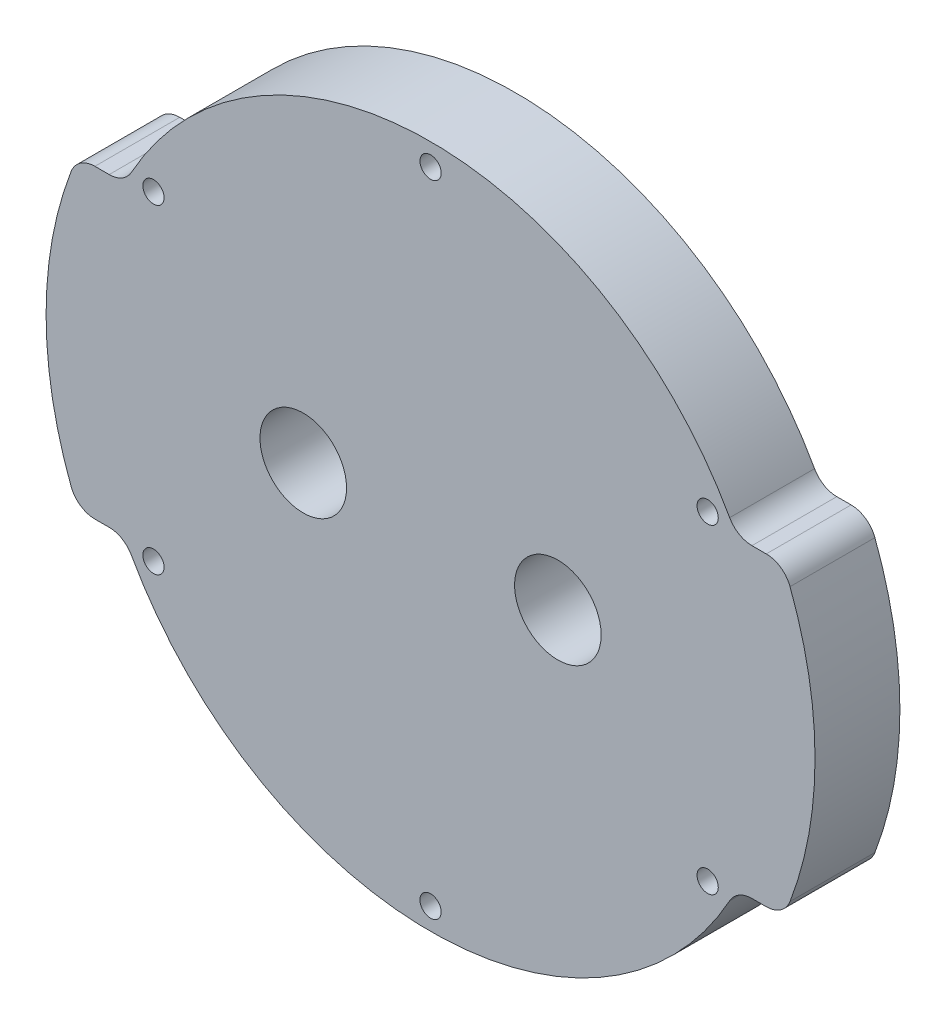
ISO-10303-21;
HEADER;
FILE_DESCRIPTION(('STEP AP214'),'2;1');
FILE_NAME('part.step','',(''),(''),'','','');
FILE_SCHEMA(('AUTOMOTIVE_DESIGN { 1 0 10303 214 1 1 1 1 }'));
ENDSEC;
DATA;
#1=APPLICATION_CONTEXT('core data for automotive mechanical design processes');
#2=APPLICATION_PROTOCOL_DEFINITION('international standard','automotive_design',2000,#1);
#3=PRODUCT_CONTEXT('',#1,'mechanical');
#4=PRODUCT('Part','Part','',(#3));
#5=PRODUCT_RELATED_PRODUCT_CATEGORY('part','',(#4));
#6=PRODUCT_DEFINITION_FORMATION('','',#4);
#7=PRODUCT_DEFINITION_CONTEXT('part definition',#1,'design');
#8=PRODUCT_DEFINITION('design','',#6,#7);
#9=PRODUCT_DEFINITION_SHAPE('','',#8);
#10=(LENGTH_UNIT() NAMED_UNIT(*) SI_UNIT(.MILLI.,.METRE.));
#11=(NAMED_UNIT(*) PLANE_ANGLE_UNIT() SI_UNIT($,.RADIAN.));
#12=(NAMED_UNIT(*) SI_UNIT($,.STERADIAN.) SOLID_ANGLE_UNIT());
#13=UNCERTAINTY_MEASURE_WITH_UNIT(LENGTH_MEASURE(1.E-05),#10,'distance_accuracy_value','');
#14=(GEOMETRIC_REPRESENTATION_CONTEXT(3) GLOBAL_UNCERTAINTY_ASSIGNED_CONTEXT((#13)) GLOBAL_UNIT_ASSIGNED_CONTEXT((#10,
#11,#12)) REPRESENTATION_CONTEXT('',''));
#15=CARTESIAN_POINT('',(0.,0.,0.));
#16=DIRECTION('',(0.,0.,1.));
#17=DIRECTION('',(1.,0.,0.));
#18=AXIS2_PLACEMENT_3D('',#15,#16,#17);
#19=CARTESIAN_POINT('',(0.,0.,10.));
#20=DIRECTION('',(0.,0.,-1.));
#21=DIRECTION('',(-1.,0.,0.));
#22=AXIS2_PLACEMENT_3D('',#19,#20,#21);
#23=CYLINDRICAL_SURFACE('',#22,45.3);
#24=CARTESIAN_POINT('',(0.,0.,0.));
#25=DIRECTION('',(0.,0.,1.));
#26=DIRECTION('',(1.,0.,0.));
#27=AXIS2_PLACEMENT_3D('',#24,#25,#26);
#28=CIRCLE('',#27,45.3);
#29=CARTESIAN_POINT('',(42.3561491706549,-16.063829787234,0.));
#30=VERTEX_POINT('',#29);
#31=CARTESIAN_POINT('',(42.3561491706549,16.063829787234,0.));
#32=VERTEX_POINT('',#31);
#33=EDGE_CURVE('E191',#30,#32,#28,.T.);
#34=ORIENTED_EDGE('',*,*,#33,.T.);
#35=DIRECTION('',(0.,0.,-1.));
#36=VECTOR('',#35,1.);
#37=CARTESIAN_POINT('',(42.3561491706549,16.063829787234,10.));
#38=LINE('',#37,#36);
#39=CARTESIAN_POINT('',(42.3561491706549,16.063829787234,10.));
#40=VERTEX_POINT('',#39);
#41=EDGE_CURVE('E201',#32,#40,#38,.F.);
#42=ORIENTED_EDGE('',*,*,#41,.T.);
#43=CARTESIAN_POINT('',(0.,0.,10.));
#44=DIRECTION('',(0.,0.,1.));
#45=DIRECTION('',(1.,0.,0.));
#46=AXIS2_PLACEMENT_3D('',#43,#44,#45);
#47=CIRCLE('',#46,45.3);
#48=CARTESIAN_POINT('',(42.3561491706549,-16.063829787234,10.));
#49=VERTEX_POINT('',#48);
#50=EDGE_CURVE('E187',#49,#40,#47,.T.);
#51=ORIENTED_EDGE('',*,*,#50,.F.);
#52=DIRECTION('',(0.,0.,-1.));
#53=VECTOR('',#52,1.);
#54=CARTESIAN_POINT('',(42.3561491706549,-16.063829787234,10.));
#55=LINE('',#54,#53);
#56=EDGE_CURVE('E198',#49,#30,#55,.T.);
#57=ORIENTED_EDGE('',*,*,#56,.T.);
#58=EDGE_LOOP('',(#34,#42,#51,#57));
#59=FACE_BOUND('',#58,.T.);
#60=ADVANCED_FACE('F33',(#59),#23,.T.);
#61=CARTESIAN_POINT('',(-42.3561491706549,16.063829787234,0.));
#62=VERTEX_POINT('',#61);
#63=CARTESIAN_POINT('',(-42.3561491706549,-16.063829787234,0.));
#64=VERTEX_POINT('',#63);
#65=EDGE_CURVE('E188',#62,#64,#28,.T.);
#66=ORIENTED_EDGE('',*,*,#65,.T.);
#67=DIRECTION('',(0.,0.,-1.));
#68=VECTOR('',#67,1.);
#69=CARTESIAN_POINT('',(-42.3561491706549,-16.063829787234,10.));
#70=LINE('',#69,#68);
#71=CARTESIAN_POINT('',(-42.3561491706549,-16.063829787234,10.));
#72=VERTEX_POINT('',#71);
#73=EDGE_CURVE('E234',#64,#72,#70,.F.);
#74=ORIENTED_EDGE('',*,*,#73,.T.);
#75=CARTESIAN_POINT('',(-42.3561491706549,16.063829787234,10.));
#76=VERTEX_POINT('',#75);
#77=EDGE_CURVE('E183',#76,#72,#47,.T.);
#78=ORIENTED_EDGE('',*,*,#77,.F.);
#79=DIRECTION('',(0.,0.,-1.));
#80=VECTOR('',#79,1.);
#81=CARTESIAN_POINT('',(-42.3561491706549,16.063829787234,10.));
#82=LINE('',#81,#80);
#83=EDGE_CURVE('E232',#76,#62,#82,.T.);
#84=ORIENTED_EDGE('',*,*,#83,.T.);
#85=EDGE_LOOP('',(#66,#74,#78,#84));
#86=FACE_BOUND('',#85,.T.);
#87=ADVANCED_FACE('F287',(#86),#23,.T.);
#88=CARTESIAN_POINT('',(0.,0.,10.));
#89=DIRECTION('',(0.,0.,1.));
#90=DIRECTION('',(1.,0.,0.));
#91=AXIS2_PLACEMENT_3D('',#88,#89,#90);
#92=PLANE('',#91);
#93=CARTESIAN_POINT('',(-15.,1.04744440165294E-13,10.));
#94=DIRECTION('',(0.,0.,1.));
#95=DIRECTION('',(1.,0.,0.));
#96=AXIS2_PLACEMENT_3D('',#93,#94,#95);
#97=CIRCLE('',#96,5.1);
#98=CARTESIAN_POINT('',(-9.9,1.04744440165294E-13,10.));
#99=VERTEX_POINT('',#98);
#100=EDGE_CURVE('E356',#99,#99,#97,.T.);
#101=ORIENTED_EDGE('',*,*,#100,.F.);
#102=EDGE_LOOP('',(#101));
#103=FACE_BOUND('',#102,.T.);
#104=CARTESIAN_POINT('',(15.,0.,10.));
#105=DIRECTION('',(0.,0.,1.));
#106=DIRECTION('',(1.,0.,0.));
#107=AXIS2_PLACEMENT_3D('',#104,#105,#106);
#108=CIRCLE('',#107,5.1);
#109=CARTESIAN_POINT('',(20.1,0.,10.));
#110=VERTEX_POINT('',#109);
#111=EDGE_CURVE('E358',#110,#110,#108,.T.);
#112=ORIENTED_EDGE('',*,*,#111,.F.);
#113=EDGE_LOOP('',(#112));
#114=FACE_BOUND('',#113,.T.);
#115=CARTESIAN_POINT('',(-32.6491577226728,18.8499999999991,10.));
#116=DIRECTION('',(0.,0.,1.));
#117=DIRECTION('',(1.,0.,0.));
#118=AXIS2_PLACEMENT_3D('',#115,#116,#117);
#119=CIRCLE('',#118,1.25000000000123);
#120=CARTESIAN_POINT('',(-31.3991577226716,18.8499999999991,10.));
#121=VERTEX_POINT('',#120);
#122=EDGE_CURVE('E364',#121,#121,#119,.T.);
#123=ORIENTED_EDGE('',*,*,#122,.F.);
#124=EDGE_LOOP('',(#123));
#125=FACE_BOUND('',#124,.T.);
#126=CARTESIAN_POINT('',(-32.6491577226717,-18.8500000000009,10.));
#127=DIRECTION('',(0.,0.,1.));
#128=DIRECTION('',(1.,0.,0.));
#129=AXIS2_PLACEMENT_3D('',#126,#127,#128);
#130=CIRCLE('',#129,1.25000000000215);
#131=CARTESIAN_POINT('',(-31.3991577226696,-18.8500000000009,10.));
#132=VERTEX_POINT('',#131);
#133=EDGE_CURVE('E370',#132,#132,#130,.T.);
#134=ORIENTED_EDGE('',*,*,#133,.F.);
#135=EDGE_LOOP('',(#134));
#136=FACE_BOUND('',#135,.T.);
#137=CARTESIAN_POINT('',(2.13376305418689E-12,-37.7,10.));
#138=DIRECTION('',(0.,0.,1.));
#139=DIRECTION('',(1.,0.,0.));
#140=AXIS2_PLACEMENT_3D('',#137,#138,#139);
#141=CIRCLE('',#140,1.25000000000229);
#142=CARTESIAN_POINT('',(1.25000000000443,-37.7,10.));
#143=VERTEX_POINT('',#142);
#144=EDGE_CURVE('E376',#143,#143,#141,.T.);
#145=ORIENTED_EDGE('',*,*,#144,.F.);
#146=EDGE_LOOP('',(#145));
#147=FACE_BOUND('',#146,.T.);
#148=CARTESIAN_POINT('',(32.6491577226749,-18.8499999999991,10.));
#149=DIRECTION('',(0.,0.,1.));
#150=DIRECTION('',(1.,0.,0.));
#151=AXIS2_PLACEMENT_3D('',#148,#149,#150);
#152=CIRCLE('',#151,1.25000000000144);
#153=CARTESIAN_POINT('',(33.8991577226764,-18.8499999999991,10.));
#154=VERTEX_POINT('',#153);
#155=EDGE_CURVE('E382',#154,#154,#152,.T.);
#156=ORIENTED_EDGE('',*,*,#155,.F.);
#157=EDGE_LOOP('',(#156));
#158=FACE_BOUND('',#157,.T.);
#159=CARTESIAN_POINT('',(32.6491577226739,18.8500000000009,10.));
#160=DIRECTION('',(0.,0.,1.));
#161=DIRECTION('',(1.,0.,0.));
#162=AXIS2_PLACEMENT_3D('',#159,#160,#161);
#163=CIRCLE('',#162,1.25000000000034);
#164=CARTESIAN_POINT('',(33.8991577226742,18.8500000000009,10.));
#165=VERTEX_POINT('',#164);
#166=EDGE_CURVE('E388',#165,#165,#163,.T.);
#167=ORIENTED_EDGE('',*,*,#166,.F.);
#168=EDGE_LOOP('',(#167));
#169=FACE_BOUND('',#168,.T.);
#170=CARTESIAN_POINT('',(0.,37.7,10.));
#171=DIRECTION('',(0.,0.,1.));
#172=DIRECTION('',(1.,0.,0.));
#173=AXIS2_PLACEMENT_3D('',#170,#171,#172);
#174=CIRCLE('',#173,1.25);
#175=CARTESIAN_POINT('',(1.25,37.7,10.));
#176=VERTEX_POINT('',#175);
#177=EDGE_CURVE('E394',#176,#176,#174,.T.);
#178=ORIENTED_EDGE('',*,*,#177,.F.);
#179=EDGE_LOOP('',(#178));
#180=FACE_BOUND('',#179,.T.);
#181=ORIENTED_EDGE('',*,*,#50,.T.);
#182=CARTESIAN_POINT('',(39.5511061792208,15.,10.));
#183=DIRECTION('',(0.,0.,1.));
#184=DIRECTION('',(1.,0.,0.));
#185=AXIS2_PLACEMENT_3D('',#182,#183,#184);
#186=CIRCLE('',#185,3.);
#187=CARTESIAN_POINT('',(39.5511061792208,18.,10.));
#188=VERTEX_POINT('',#187);
#189=EDGE_CURVE('E173',#40,#188,#186,.T.);
#190=ORIENTED_EDGE('',*,*,#189,.T.);
#191=DIRECTION('',(1.,0.,0.));
#192=VECTOR('',#191,1.);
#193=CARTESIAN_POINT('',(36.0567608084808,18.,10.));
#194=LINE('',#193,#192);
#195=CARTESIAN_POINT('',(37.8667400234031,18.,10.));
#196=VERTEX_POINT('',#195);
#197=EDGE_CURVE('E164',#196,#188,#194,.T.);
#198=ORIENTED_EDGE('',*,*,#197,.F.);
#199=CARTESIAN_POINT('',(37.8667400234031,21.,10.));
#200=DIRECTION('',(0.,0.,1.));
#201=DIRECTION('',(1.,0.,0.));
#202=AXIS2_PLACEMENT_3D('',#199,#200,#201);
#203=CIRCLE('',#202,3.);
#204=CARTESIAN_POINT('',(35.2431783589641,19.5450346420323,10.));
#205=VERTEX_POINT('',#204);
#206=EDGE_CURVE('E147',#196,#205,#203,.F.);
#207=ORIENTED_EDGE('',*,*,#206,.T.);
#208=CARTESIAN_POINT('',(0.,0.,10.));
#209=DIRECTION('',(0.,0.,-1.));
#210=DIRECTION('',(1.,0.,0.));
#211=AXIS2_PLACEMENT_3D('',#208,#209,#210);
#212=CIRCLE('',#211,40.3);
#213=CARTESIAN_POINT('',(-35.2431783589641,19.5450346420323,10.));
#214=VERTEX_POINT('',#213);
#215=EDGE_CURVE('E175',#214,#205,#212,.T.);
#216=ORIENTED_EDGE('',*,*,#215,.F.);
#217=CARTESIAN_POINT('',(-37.8667400234031,21.,10.));
#218=DIRECTION('',(0.,0.,1.));
#219=DIRECTION('',(1.,0.,0.));
#220=AXIS2_PLACEMENT_3D('',#217,#218,#219);
#221=CIRCLE('',#220,3.);
#222=CARTESIAN_POINT('',(-37.8667400234031,18.,10.));
#223=VERTEX_POINT('',#222);
#224=EDGE_CURVE('E41',#214,#223,#221,.F.);
#225=ORIENTED_EDGE('',*,*,#224,.T.);
#226=DIRECTION('',(1.,0.,0.));
#227=VECTOR('',#226,1.);
#228=CARTESIAN_POINT('',(-36.0567608084808,18.,10.));
#229=LINE('',#228,#227);
#230=CARTESIAN_POINT('',(-39.5511061792208,18.,10.));
#231=VERTEX_POINT('',#230);
#232=EDGE_CURVE('E174',#231,#223,#229,.T.);
#233=ORIENTED_EDGE('',*,*,#232,.F.);
#234=CARTESIAN_POINT('',(-39.5511061792208,15.,10.));
#235=DIRECTION('',(0.,0.,1.));
#236=DIRECTION('',(1.,0.,0.));
#237=AXIS2_PLACEMENT_3D('',#234,#235,#236);
#238=CIRCLE('',#237,3.);
#239=EDGE_CURVE('E204',#231,#76,#238,.T.);
#240=ORIENTED_EDGE('',*,*,#239,.T.);
#241=ORIENTED_EDGE('',*,*,#77,.T.);
#242=CARTESIAN_POINT('',(-39.5511061792208,-15.,10.));
#243=DIRECTION('',(0.,0.,1.));
#244=DIRECTION('',(1.,0.,0.));
#245=AXIS2_PLACEMENT_3D('',#242,#243,#244);
#246=CIRCLE('',#245,3.);
#247=CARTESIAN_POINT('',(-39.5511061792208,-18.,10.));
#248=VERTEX_POINT('',#247);
#249=EDGE_CURVE('E206',#72,#248,#246,.T.);
#250=ORIENTED_EDGE('',*,*,#249,.T.);
#251=DIRECTION('',(-1.,0.,0.));
#252=VECTOR('',#251,1.);
#253=CARTESIAN_POINT('',(-36.0567608084808,-18.,10.));
#254=LINE('',#253,#252);
#255=CARTESIAN_POINT('',(-37.8667400234031,-18.,10.));
#256=VERTEX_POINT('',#255);
#257=EDGE_CURVE('E409',#256,#248,#254,.T.);
#258=ORIENTED_EDGE('',*,*,#257,.F.);
#259=CARTESIAN_POINT('',(-37.8667400234031,-21.,10.));
#260=DIRECTION('',(0.,0.,1.));
#261=DIRECTION('',(1.,0.,0.));
#262=AXIS2_PLACEMENT_3D('',#259,#260,#261);
#263=CIRCLE('',#262,3.);
#264=CARTESIAN_POINT('',(-35.2431783589641,-19.5450346420323,10.));
#265=VERTEX_POINT('',#264);
#266=EDGE_CURVE('E245',#256,#265,#263,.F.);
#267=ORIENTED_EDGE('',*,*,#266,.T.);
#268=CARTESIAN_POINT('',(0.,0.,10.));
#269=DIRECTION('',(0.,0.,-1.));
#270=DIRECTION('',(1.,0.,0.));
#271=AXIS2_PLACEMENT_3D('',#268,#269,#270);
#272=CIRCLE('',#271,40.3);
#273=CARTESIAN_POINT('',(35.2431783589641,-19.5450346420323,10.));
#274=VERTEX_POINT('',#273);
#275=EDGE_CURVE('E400',#274,#265,#272,.T.);
#276=ORIENTED_EDGE('',*,*,#275,.F.);
#277=CARTESIAN_POINT('',(37.8667400234031,-21.,10.));
#278=DIRECTION('',(0.,0.,1.));
#279=DIRECTION('',(1.,0.,0.));
#280=AXIS2_PLACEMENT_3D('',#277,#278,#279);
#281=CIRCLE('',#280,3.);
#282=CARTESIAN_POINT('',(37.8667400234031,-18.,10.));
#283=VERTEX_POINT('',#282);
#284=EDGE_CURVE('E241',#274,#283,#281,.F.);
#285=ORIENTED_EDGE('',*,*,#284,.T.);
#286=DIRECTION('',(-1.,0.,0.));
#287=VECTOR('',#286,1.);
#288=CARTESIAN_POINT('',(36.0567608084808,-18.,10.));
#289=LINE('',#288,#287);
#290=CARTESIAN_POINT('',(39.5511061792208,-18.,10.));
#291=VERTEX_POINT('',#290);
#292=EDGE_CURVE('E263',#291,#283,#289,.T.);
#293=ORIENTED_EDGE('',*,*,#292,.F.);
#294=CARTESIAN_POINT('',(39.5511061792208,-15.,10.));
#295=DIRECTION('',(0.,0.,1.));
#296=DIRECTION('',(1.,0.,0.));
#297=AXIS2_PLACEMENT_3D('',#294,#295,#296);
#298=CIRCLE('',#297,3.);
#299=EDGE_CURVE('E208',#291,#49,#298,.T.);
#300=ORIENTED_EDGE('',*,*,#299,.T.);
#301=EDGE_LOOP('',(#181,#190,#198,#207,#216,#225,#233,#240,#241,#250,#258,#267,#276,#285,#293,#300));
#302=FACE_BOUND('',#301,.T.);
#303=ADVANCED_FACE('F172',(#103,#114,#125,#136,#147,#158,#169,#180,#302),#92,.T.);
#304=CARTESIAN_POINT('',(0.,0.,0.));
#305=DIRECTION('',(0.,0.,1.));
#306=DIRECTION('',(1.,0.,0.));
#307=AXIS2_PLACEMENT_3D('',#304,#305,#306);
#308=PLANE('',#307);
#309=CARTESIAN_POINT('',(-15.,1.04744440165294E-13,0.));
#310=DIRECTION('',(0.,0.,1.));
#311=DIRECTION('',(1.,0.,0.));
#312=AXIS2_PLACEMENT_3D('',#309,#310,#311);
#313=CIRCLE('',#312,5.1);
#314=CARTESIAN_POINT('',(-9.9,1.04744440165294E-13,0.));
#315=VERTEX_POINT('',#314);
#316=EDGE_CURVE('E353',#315,#315,#313,.T.);
#317=ORIENTED_EDGE('',*,*,#316,.T.);
#318=EDGE_LOOP('',(#317));
#319=FACE_BOUND('',#318,.T.);
#320=CARTESIAN_POINT('',(15.,0.,0.));
#321=DIRECTION('',(0.,0.,1.));
#322=DIRECTION('',(1.,0.,0.));
#323=AXIS2_PLACEMENT_3D('',#320,#321,#322);
#324=CIRCLE('',#323,5.1);
#325=CARTESIAN_POINT('',(20.1,0.,0.));
#326=VERTEX_POINT('',#325);
#327=EDGE_CURVE('E361',#326,#326,#324,.T.);
#328=ORIENTED_EDGE('',*,*,#327,.T.);
#329=EDGE_LOOP('',(#328));
#330=FACE_BOUND('',#329,.T.);
#331=CARTESIAN_POINT('',(-32.6491577226728,18.8499999999991,0.));
#332=DIRECTION('',(0.,0.,1.));
#333=DIRECTION('',(1.,0.,0.));
#334=AXIS2_PLACEMENT_3D('',#331,#332,#333);
#335=CIRCLE('',#334,1.25000000000123);
#336=CARTESIAN_POINT('',(-31.3991577226716,18.8499999999991,0.));
#337=VERTEX_POINT('',#336);
#338=EDGE_CURVE('E367',#337,#337,#335,.T.);
#339=ORIENTED_EDGE('',*,*,#338,.T.);
#340=EDGE_LOOP('',(#339));
#341=FACE_BOUND('',#340,.T.);
#342=CARTESIAN_POINT('',(-32.6491577226717,-18.8500000000009,0.));
#343=DIRECTION('',(0.,0.,1.));
#344=DIRECTION('',(1.,0.,0.));
#345=AXIS2_PLACEMENT_3D('',#342,#343,#344);
#346=CIRCLE('',#345,1.25000000000215);
#347=CARTESIAN_POINT('',(-31.3991577226696,-18.8500000000009,0.));
#348=VERTEX_POINT('',#347);
#349=EDGE_CURVE('E373',#348,#348,#346,.T.);
#350=ORIENTED_EDGE('',*,*,#349,.T.);
#351=EDGE_LOOP('',(#350));
#352=FACE_BOUND('',#351,.T.);
#353=CARTESIAN_POINT('',(2.13376305418689E-12,-37.7,0.));
#354=DIRECTION('',(0.,0.,1.));
#355=DIRECTION('',(1.,0.,0.));
#356=AXIS2_PLACEMENT_3D('',#353,#354,#355);
#357=CIRCLE('',#356,1.25000000000229);
#358=CARTESIAN_POINT('',(1.25000000000443,-37.7,0.));
#359=VERTEX_POINT('',#358);
#360=EDGE_CURVE('E379',#359,#359,#357,.T.);
#361=ORIENTED_EDGE('',*,*,#360,.T.);
#362=EDGE_LOOP('',(#361));
#363=FACE_BOUND('',#362,.T.);
#364=CARTESIAN_POINT('',(32.6491577226749,-18.8499999999991,0.));
#365=DIRECTION('',(0.,0.,1.));
#366=DIRECTION('',(1.,0.,0.));
#367=AXIS2_PLACEMENT_3D('',#364,#365,#366);
#368=CIRCLE('',#367,1.25000000000144);
#369=CARTESIAN_POINT('',(33.8991577226764,-18.8499999999991,0.));
#370=VERTEX_POINT('',#369);
#371=EDGE_CURVE('E385',#370,#370,#368,.T.);
#372=ORIENTED_EDGE('',*,*,#371,.T.);
#373=EDGE_LOOP('',(#372));
#374=FACE_BOUND('',#373,.T.);
#375=CARTESIAN_POINT('',(32.6491577226739,18.8500000000009,0.));
#376=DIRECTION('',(0.,0.,1.));
#377=DIRECTION('',(1.,0.,0.));
#378=AXIS2_PLACEMENT_3D('',#375,#376,#377);
#379=CIRCLE('',#378,1.25000000000034);
#380=CARTESIAN_POINT('',(33.8991577226742,18.8500000000009,0.));
#381=VERTEX_POINT('',#380);
#382=EDGE_CURVE('E391',#381,#381,#379,.T.);
#383=ORIENTED_EDGE('',*,*,#382,.T.);
#384=EDGE_LOOP('',(#383));
#385=FACE_BOUND('',#384,.T.);
#386=CARTESIAN_POINT('',(0.,37.7,0.));
#387=DIRECTION('',(0.,0.,1.));
#388=DIRECTION('',(1.,0.,0.));
#389=AXIS2_PLACEMENT_3D('',#386,#387,#388);
#390=CIRCLE('',#389,1.25);
#391=CARTESIAN_POINT('',(1.25,37.7,0.));
#392=VERTEX_POINT('',#391);
#393=EDGE_CURVE('E397',#392,#392,#390,.T.);
#394=ORIENTED_EDGE('',*,*,#393,.T.);
#395=EDGE_LOOP('',(#394));
#396=FACE_BOUND('',#395,.T.);
#397=DIRECTION('',(1.,0.,0.));
#398=VECTOR('',#397,1.);
#399=CARTESIAN_POINT('',(36.0567608084808,18.,0.));
#400=LINE('',#399,#398);
#401=CARTESIAN_POINT('',(37.8667400234031,18.,0.));
#402=VERTEX_POINT('',#401);
#403=CARTESIAN_POINT('',(39.5511061792208,18.,0.));
#404=VERTEX_POINT('',#403);
#405=EDGE_CURVE('E167',#402,#404,#400,.T.);
#406=ORIENTED_EDGE('',*,*,#405,.T.);
#407=CARTESIAN_POINT('',(39.5511061792208,15.,0.));
#408=DIRECTION('',(0.,0.,1.));
#409=DIRECTION('',(1.,0.,0.));
#410=AXIS2_PLACEMENT_3D('',#407,#408,#409);
#411=CIRCLE('',#410,3.);
#412=EDGE_CURVE('E216',#404,#32,#411,.F.);
#413=ORIENTED_EDGE('',*,*,#412,.T.);
#414=ORIENTED_EDGE('',*,*,#33,.F.);
#415=CARTESIAN_POINT('',(39.5511061792208,-15.,0.));
#416=DIRECTION('',(0.,0.,1.));
#417=DIRECTION('',(1.,0.,0.));
#418=AXIS2_PLACEMENT_3D('',#415,#416,#417);
#419=CIRCLE('',#418,3.);
#420=CARTESIAN_POINT('',(39.5511061792208,-18.,0.));
#421=VERTEX_POINT('',#420);
#422=EDGE_CURVE('E214',#30,#421,#419,.F.);
#423=ORIENTED_EDGE('',*,*,#422,.T.);
#424=DIRECTION('',(-1.,0.,0.));
#425=VECTOR('',#424,1.);
#426=CARTESIAN_POINT('',(0.,-18.,0.));
#427=LINE('',#426,#425);
#428=CARTESIAN_POINT('',(37.8667400234031,-18.,0.));
#429=VERTEX_POINT('',#428);
#430=EDGE_CURVE('E186',#421,#429,#427,.T.);
#431=ORIENTED_EDGE('',*,*,#430,.T.);
#432=CARTESIAN_POINT('',(37.8667400234031,-21.,0.));
#433=DIRECTION('',(0.,0.,1.));
#434=DIRECTION('',(1.,0.,0.));
#435=AXIS2_PLACEMENT_3D('',#432,#433,#434);
#436=CIRCLE('',#435,3.);
#437=CARTESIAN_POINT('',(35.2431783589641,-19.5450346420323,0.));
#438=VERTEX_POINT('',#437);
#439=EDGE_CURVE('E243',#429,#438,#436,.T.);
#440=ORIENTED_EDGE('',*,*,#439,.T.);
#441=CARTESIAN_POINT('',(0.,0.,0.));
#442=DIRECTION('',(0.,0.,-1.));
#443=DIRECTION('',(1.,0.,0.));
#444=AXIS2_PLACEMENT_3D('',#441,#442,#443);
#445=CIRCLE('',#444,40.3);
#446=CARTESIAN_POINT('',(-35.2431783589641,-19.5450346420323,0.));
#447=VERTEX_POINT('',#446);
#448=EDGE_CURVE('E403',#438,#447,#445,.T.);
#449=ORIENTED_EDGE('',*,*,#448,.T.);
#450=CARTESIAN_POINT('',(-37.8667400234031,-21.,0.));
#451=DIRECTION('',(0.,0.,1.));
#452=DIRECTION('',(1.,0.,0.));
#453=AXIS2_PLACEMENT_3D('',#450,#451,#452);
#454=CIRCLE('',#453,3.);
#455=CARTESIAN_POINT('',(-37.8667400234031,-18.,0.));
#456=VERTEX_POINT('',#455);
#457=EDGE_CURVE('E247',#447,#456,#454,.T.);
#458=ORIENTED_EDGE('',*,*,#457,.T.);
#459=DIRECTION('',(-1.,0.,0.));
#460=VECTOR('',#459,1.);
#461=CARTESIAN_POINT('',(-36.0567608084808,-18.,0.));
#462=LINE('',#461,#460);
#463=CARTESIAN_POINT('',(-39.5511061792208,-18.,0.));
#464=VERTEX_POINT('',#463);
#465=EDGE_CURVE('E179',#456,#464,#462,.T.);
#466=ORIENTED_EDGE('',*,*,#465,.T.);
#467=CARTESIAN_POINT('',(-39.5511061792208,-15.,0.));
#468=DIRECTION('',(0.,0.,1.));
#469=DIRECTION('',(1.,0.,0.));
#470=AXIS2_PLACEMENT_3D('',#467,#468,#469);
#471=CIRCLE('',#470,3.);
#472=EDGE_CURVE('E212',#464,#64,#471,.F.);
#473=ORIENTED_EDGE('',*,*,#472,.T.);
#474=ORIENTED_EDGE('',*,*,#65,.F.);
#475=CARTESIAN_POINT('',(-39.5511061792208,15.,0.));
#476=DIRECTION('',(0.,0.,1.));
#477=DIRECTION('',(1.,0.,0.));
#478=AXIS2_PLACEMENT_3D('',#475,#476,#477);
#479=CIRCLE('',#478,3.);
#480=CARTESIAN_POINT('',(-39.5511061792208,18.,0.));
#481=VERTEX_POINT('',#480);
#482=EDGE_CURVE('E55',#62,#481,#479,.F.);
#483=ORIENTED_EDGE('',*,*,#482,.T.);
#484=DIRECTION('',(1.,0.,0.));
#485=VECTOR('',#484,1.);
#486=CARTESIAN_POINT('',(-36.0567608084808,18.,0.));
#487=LINE('',#486,#485);
#488=CARTESIAN_POINT('',(-37.8667400234031,18.,0.));
#489=VERTEX_POINT('',#488);
#490=EDGE_CURVE('E257',#481,#489,#487,.T.);
#491=ORIENTED_EDGE('',*,*,#490,.T.);
#492=CARTESIAN_POINT('',(-37.8667400234031,21.,0.));
#493=DIRECTION('',(0.,0.,1.));
#494=DIRECTION('',(1.,0.,0.));
#495=AXIS2_PLACEMENT_3D('',#492,#493,#494);
#496=CIRCLE('',#495,3.);
#497=CARTESIAN_POINT('',(-35.2431783589641,19.5450346420323,0.));
#498=VERTEX_POINT('',#497);
#499=EDGE_CURVE('E11',#489,#498,#496,.T.);
#500=ORIENTED_EDGE('',*,*,#499,.T.);
#501=CARTESIAN_POINT('',(0.,0.,0.));
#502=DIRECTION('',(0.,0.,-1.));
#503=DIRECTION('',(1.,0.,0.));
#504=AXIS2_PLACEMENT_3D('',#501,#502,#503);
#505=CIRCLE('',#504,40.3);
#506=CARTESIAN_POINT('',(35.2431783589641,19.5450346420323,0.));
#507=VERTEX_POINT('',#506);
#508=EDGE_CURVE('E177',#498,#507,#505,.T.);
#509=ORIENTED_EDGE('',*,*,#508,.T.);
#510=CARTESIAN_POINT('',(37.8667400234031,21.,0.));
#511=DIRECTION('',(0.,0.,1.));
#512=DIRECTION('',(1.,0.,0.));
#513=AXIS2_PLACEMENT_3D('',#510,#511,#512);
#514=CIRCLE('',#513,3.);
#515=EDGE_CURVE('E157',#507,#402,#514,.T.);
#516=ORIENTED_EDGE('',*,*,#515,.T.);
#517=EDGE_LOOP('',(#406,#413,#414,#423,#431,#440,#449,#458,#466,#473,#474,#483,#491,#500,#509,#516));
#518=FACE_BOUND('',#517,.T.);
#519=ADVANCED_FACE('F256',(#319,#330,#341,#352,#363,#374,#385,#396,#518),#308,.F.);
#520=CARTESIAN_POINT('',(0.,0.,0.));
#521=DIRECTION('',(0.,0.,1.));
#522=DIRECTION('',(1.,0.,0.));
#523=AXIS2_PLACEMENT_3D('',#520,#521,#522);
#524=CYLINDRICAL_SURFACE('',#523,40.3);
#525=ORIENTED_EDGE('',*,*,#215,.T.);
#526=DIRECTION('',(0.,0.,1.));
#527=VECTOR('',#526,1.);
#528=CARTESIAN_POINT('',(35.2431783589641,19.5450346420323,0.));
#529=LINE('',#528,#527);
#530=EDGE_CURVE('E152',#205,#507,#529,.F.);
#531=ORIENTED_EDGE('',*,*,#530,.T.);
#532=ORIENTED_EDGE('',*,*,#508,.F.);
#533=DIRECTION('',(0.,0.,1.));
#534=VECTOR('',#533,1.);
#535=CARTESIAN_POINT('',(-35.2431783589641,19.5450346420323,0.));
#536=LINE('',#535,#534);
#537=EDGE_CURVE('E168',#498,#214,#536,.T.);
#538=ORIENTED_EDGE('',*,*,#537,.T.);
#539=EDGE_LOOP('',(#525,#531,#532,#538));
#540=FACE_BOUND('',#539,.T.);
#541=ADVANCED_FACE('F259',(#540),#524,.T.);
#542=CARTESIAN_POINT('',(-36.0567608084808,18.,0.));
#543=DIRECTION('',(0.,-1.,0.));
#544=DIRECTION('',(1.,0.,0.));
#545=AXIS2_PLACEMENT_3D('',#542,#543,#544);
#546=PLANE('',#545);
#547=ORIENTED_EDGE('',*,*,#490,.F.);
#548=DIRECTION('',(0.,0.,-1.));
#549=VECTOR('',#548,1.);
#550=CARTESIAN_POINT('',(-39.5511061792208,18.,0.));
#551=LINE('',#550,#549);
#552=EDGE_CURVE('E158',#481,#231,#551,.F.);
#553=ORIENTED_EDGE('',*,*,#552,.T.);
#554=ORIENTED_EDGE('',*,*,#232,.T.);
#555=DIRECTION('',(0.,0.,-1.));
#556=VECTOR('',#555,1.);
#557=CARTESIAN_POINT('',(-37.8667400234031,18.,0.));
#558=LINE('',#557,#556);
#559=EDGE_CURVE('E48',#223,#489,#558,.T.);
#560=ORIENTED_EDGE('',*,*,#559,.T.);
#561=EDGE_LOOP('',(#547,#553,#554,#560));
#562=FACE_BOUND('',#561,.T.);
#563=ADVANCED_FACE('F251',(#562),#546,.F.);
#564=CARTESIAN_POINT('',(36.0567608084808,18.,0.));
#565=DIRECTION('',(0.,-1.,0.));
#566=DIRECTION('',(1.,0.,0.));
#567=AXIS2_PLACEMENT_3D('',#564,#565,#566);
#568=PLANE('',#567);
#569=ORIENTED_EDGE('',*,*,#405,.F.);
#570=DIRECTION('',(0.,0.,-1.));
#571=VECTOR('',#570,1.);
#572=CARTESIAN_POINT('',(37.8667400234031,18.,10.));
#573=LINE('',#572,#571);
#574=EDGE_CURVE('E151',#402,#196,#573,.F.);
#575=ORIENTED_EDGE('',*,*,#574,.T.);
#576=ORIENTED_EDGE('',*,*,#197,.T.);
#577=DIRECTION('',(0.,0.,-1.));
#578=VECTOR('',#577,1.);
#579=CARTESIAN_POINT('',(39.5511061792208,18.,0.));
#580=LINE('',#579,#578);
#581=EDGE_CURVE('E169',#188,#404,#580,.T.);
#582=ORIENTED_EDGE('',*,*,#581,.T.);
#583=EDGE_LOOP('',(#569,#575,#576,#582));
#584=FACE_BOUND('',#583,.T.);
#585=ADVANCED_FACE('F163',(#584),#568,.F.);
#586=CARTESIAN_POINT('',(36.0567608084808,-18.,0.));
#587=DIRECTION('',(0.,1.,0.));
#588=DIRECTION('',(0.,0.,1.));
#589=AXIS2_PLACEMENT_3D('',#586,#587,#588);
#590=PLANE('',#589);
#591=ORIENTED_EDGE('',*,*,#430,.F.);
#592=DIRECTION('',(0.,0.,-1.));
#593=VECTOR('',#592,1.);
#594=CARTESIAN_POINT('',(39.5511061792208,-18.,0.));
#595=LINE('',#594,#593);
#596=EDGE_CURVE('E220',#421,#291,#595,.F.);
#597=ORIENTED_EDGE('',*,*,#596,.T.);
#598=ORIENTED_EDGE('',*,*,#292,.T.);
#599=DIRECTION('',(0.,0.,-1.));
#600=VECTOR('',#599,1.);
#601=CARTESIAN_POINT('',(37.8667400234031,-18.,0.));
#602=LINE('',#601,#600);
#603=EDGE_CURVE('E218',#283,#429,#602,.T.);
#604=ORIENTED_EDGE('',*,*,#603,.T.);
#605=EDGE_LOOP('',(#591,#597,#598,#604));
#606=FACE_BOUND('',#605,.T.);
#607=ADVANCED_FACE('F304',(#606),#590,.F.);
#608=CARTESIAN_POINT('',(-36.0567608084808,-18.,0.));
#609=DIRECTION('',(0.,1.,0.));
#610=DIRECTION('',(0.,0.,1.));
#611=AXIS2_PLACEMENT_3D('',#608,#609,#610);
#612=PLANE('',#611);
#613=ORIENTED_EDGE('',*,*,#465,.F.);
#614=DIRECTION('',(0.,0.,-1.));
#615=VECTOR('',#614,1.);
#616=CARTESIAN_POINT('',(-37.8667400234031,-18.,10.));
#617=LINE('',#616,#615);
#618=EDGE_CURVE('E229',#456,#256,#617,.F.);
#619=ORIENTED_EDGE('',*,*,#618,.T.);
#620=ORIENTED_EDGE('',*,*,#257,.T.);
#621=DIRECTION('',(0.,0.,-1.));
#622=VECTOR('',#621,1.);
#623=CARTESIAN_POINT('',(-39.5511061792208,-18.,0.));
#624=LINE('',#623,#622);
#625=EDGE_CURVE('E227',#248,#464,#624,.T.);
#626=ORIENTED_EDGE('',*,*,#625,.T.);
#627=EDGE_LOOP('',(#613,#619,#620,#626));
#628=FACE_BOUND('',#627,.T.);
#629=ADVANCED_FACE('F309',(#628),#612,.F.);
#630=CARTESIAN_POINT('',(0.,0.,0.));
#631=DIRECTION('',(0.,0.,1.));
#632=DIRECTION('',(1.,0.,0.));
#633=AXIS2_PLACEMENT_3D('',#630,#631,#632);
#634=CYLINDRICAL_SURFACE('',#633,40.3);
#635=ORIENTED_EDGE('',*,*,#448,.F.);
#636=DIRECTION('',(0.,0.,1.));
#637=VECTOR('',#636,1.);
#638=CARTESIAN_POINT('',(35.2431783589641,-19.5450346420323,0.));
#639=LINE('',#638,#637);
#640=EDGE_CURVE('E224',#438,#274,#639,.T.);
#641=ORIENTED_EDGE('',*,*,#640,.T.);
#642=ORIENTED_EDGE('',*,*,#275,.T.);
#643=DIRECTION('',(0.,0.,1.));
#644=VECTOR('',#643,1.);
#645=CARTESIAN_POINT('',(-35.2431783589641,-19.5450346420323,0.));
#646=LINE('',#645,#644);
#647=EDGE_CURVE('E222',#265,#447,#646,.F.);
#648=ORIENTED_EDGE('',*,*,#647,.T.);
#649=EDGE_LOOP('',(#635,#641,#642,#648));
#650=FACE_BOUND('',#649,.T.);
#651=ADVANCED_FACE('F284',(#650),#634,.T.);
#652=CARTESIAN_POINT('',(37.8667400234031,21.,0.));
#653=DIRECTION('',(0.,0.,1.));
#654=DIRECTION('',(1.,0.,0.));
#655=AXIS2_PLACEMENT_3D('',#652,#653,#654);
#656=CYLINDRICAL_SURFACE('',#655,3.);
#657=ORIENTED_EDGE('',*,*,#515,.F.);
#658=ORIENTED_EDGE('',*,*,#530,.F.);
#659=ORIENTED_EDGE('',*,*,#206,.F.);
#660=ORIENTED_EDGE('',*,*,#574,.F.);
#661=EDGE_LOOP('',(#657,#658,#659,#660));
#662=FACE_BOUND('',#661,.T.);
#663=ADVANCED_FACE('F150',(#662),#656,.F.);
#664=CARTESIAN_POINT('',(39.5511061792208,15.,10.));
#665=DIRECTION('',(0.,0.,-1.));
#666=DIRECTION('',(-1.,0.,0.));
#667=AXIS2_PLACEMENT_3D('',#664,#665,#666);
#668=CYLINDRICAL_SURFACE('',#667,3.);
#669=ORIENTED_EDGE('',*,*,#412,.F.);
#670=ORIENTED_EDGE('',*,*,#581,.F.);
#671=ORIENTED_EDGE('',*,*,#189,.F.);
#672=ORIENTED_EDGE('',*,*,#41,.F.);
#673=EDGE_LOOP('',(#669,#670,#671,#672));
#674=FACE_BOUND('',#673,.T.);
#675=ADVANCED_FACE('F273',(#674),#668,.T.);
#676=CARTESIAN_POINT('',(39.5511061792208,-15.,10.));
#677=DIRECTION('',(0.,0.,-1.));
#678=DIRECTION('',(-1.,0.,0.));
#679=AXIS2_PLACEMENT_3D('',#676,#677,#678);
#680=CYLINDRICAL_SURFACE('',#679,3.);
#681=ORIENTED_EDGE('',*,*,#299,.F.);
#682=ORIENTED_EDGE('',*,*,#596,.F.);
#683=ORIENTED_EDGE('',*,*,#422,.F.);
#684=ORIENTED_EDGE('',*,*,#56,.F.);
#685=EDGE_LOOP('',(#681,#682,#683,#684));
#686=FACE_BOUND('',#685,.T.);
#687=ADVANCED_FACE('F275',(#686),#680,.T.);
#688=CARTESIAN_POINT('',(37.8667400234031,-21.,0.));
#689=DIRECTION('',(0.,0.,1.));
#690=DIRECTION('',(1.,0.,0.));
#691=AXIS2_PLACEMENT_3D('',#688,#689,#690);
#692=CYLINDRICAL_SURFACE('',#691,3.);
#693=ORIENTED_EDGE('',*,*,#439,.F.);
#694=ORIENTED_EDGE('',*,*,#603,.F.);
#695=ORIENTED_EDGE('',*,*,#284,.F.);
#696=ORIENTED_EDGE('',*,*,#640,.F.);
#697=EDGE_LOOP('',(#693,#694,#695,#696));
#698=FACE_BOUND('',#697,.T.);
#699=ADVANCED_FACE('F281',(#698),#692,.F.);
#700=CARTESIAN_POINT('',(-37.8667400234031,-21.,0.));
#701=DIRECTION('',(0.,0.,1.));
#702=DIRECTION('',(1.,0.,0.));
#703=AXIS2_PLACEMENT_3D('',#700,#701,#702);
#704=CYLINDRICAL_SURFACE('',#703,3.);
#705=ORIENTED_EDGE('',*,*,#457,.F.);
#706=ORIENTED_EDGE('',*,*,#647,.F.);
#707=ORIENTED_EDGE('',*,*,#266,.F.);
#708=ORIENTED_EDGE('',*,*,#618,.F.);
#709=EDGE_LOOP('',(#705,#706,#707,#708));
#710=FACE_BOUND('',#709,.T.);
#711=ADVANCED_FACE('F427',(#710),#704,.F.);
#712=CARTESIAN_POINT('',(-39.5511061792208,-15.,10.));
#713=DIRECTION('',(0.,0.,-1.));
#714=DIRECTION('',(-1.,0.,0.));
#715=AXIS2_PLACEMENT_3D('',#712,#713,#714);
#716=CYLINDRICAL_SURFACE('',#715,3.);
#717=ORIENTED_EDGE('',*,*,#472,.F.);
#718=ORIENTED_EDGE('',*,*,#625,.F.);
#719=ORIENTED_EDGE('',*,*,#249,.F.);
#720=ORIENTED_EDGE('',*,*,#73,.F.);
#721=EDGE_LOOP('',(#717,#718,#719,#720));
#722=FACE_BOUND('',#721,.T.);
#723=ADVANCED_FACE('F432',(#722),#716,.T.);
#724=CARTESIAN_POINT('',(-39.5511061792208,15.,10.));
#725=DIRECTION('',(0.,0.,-1.));
#726=DIRECTION('',(-1.,0.,0.));
#727=AXIS2_PLACEMENT_3D('',#724,#725,#726);
#728=CYLINDRICAL_SURFACE('',#727,3.);
#729=ORIENTED_EDGE('',*,*,#482,.F.);
#730=ORIENTED_EDGE('',*,*,#83,.F.);
#731=ORIENTED_EDGE('',*,*,#239,.F.);
#732=ORIENTED_EDGE('',*,*,#552,.F.);
#733=EDGE_LOOP('',(#729,#730,#731,#732));
#734=FACE_BOUND('',#733,.T.);
#735=ADVANCED_FACE('F437',(#734),#728,.T.);
#736=CARTESIAN_POINT('',(-37.8667400234031,21.,0.));
#737=DIRECTION('',(0.,0.,1.));
#738=DIRECTION('',(1.,0.,0.));
#739=AXIS2_PLACEMENT_3D('',#736,#737,#738);
#740=CYLINDRICAL_SURFACE('',#739,3.);
#741=ORIENTED_EDGE('',*,*,#499,.F.);
#742=ORIENTED_EDGE('',*,*,#559,.F.);
#743=ORIENTED_EDGE('',*,*,#224,.F.);
#744=ORIENTED_EDGE('',*,*,#537,.F.);
#745=EDGE_LOOP('',(#741,#742,#743,#744));
#746=FACE_BOUND('',#745,.T.);
#747=ADVANCED_FACE('F35',(#746),#740,.F.);
#748=CARTESIAN_POINT('',(0.,37.7,0.));
#749=DIRECTION('',(0.,0.,1.));
#750=DIRECTION('',(1.,0.,0.));
#751=AXIS2_PLACEMENT_3D('',#748,#749,#750);
#752=CYLINDRICAL_SURFACE('',#751,1.25);
#753=ORIENTED_EDGE('',*,*,#393,.F.);
#754=EDGE_LOOP('',(#753));
#755=FACE_BOUND('',#754,.T.);
#756=ORIENTED_EDGE('',*,*,#177,.T.);
#757=EDGE_LOOP('',(#756));
#758=FACE_BOUND('',#757,.T.);
#759=ADVANCED_FACE('F317',(#755,#758),#752,.F.);
#760=CARTESIAN_POINT('',(32.6491577226739,18.8500000000009,0.));
#761=DIRECTION('',(0.,0.,1.));
#762=DIRECTION('',(1.,0.,0.));
#763=AXIS2_PLACEMENT_3D('',#760,#761,#762);
#764=CYLINDRICAL_SURFACE('',#763,1.25000000000034);
#765=ORIENTED_EDGE('',*,*,#382,.F.);
#766=EDGE_LOOP('',(#765));
#767=FACE_BOUND('',#766,.T.);
#768=ORIENTED_EDGE('',*,*,#166,.T.);
#769=EDGE_LOOP('',(#768));
#770=FACE_BOUND('',#769,.T.);
#771=ADVANCED_FACE('F320',(#767,#770),#764,.F.);
#772=CARTESIAN_POINT('',(32.6491577226749,-18.8499999999991,0.));
#773=DIRECTION('',(0.,0.,1.));
#774=DIRECTION('',(1.,0.,0.));
#775=AXIS2_PLACEMENT_3D('',#772,#773,#774);
#776=CYLINDRICAL_SURFACE('',#775,1.25000000000144);
#777=ORIENTED_EDGE('',*,*,#371,.F.);
#778=EDGE_LOOP('',(#777));
#779=FACE_BOUND('',#778,.T.);
#780=ORIENTED_EDGE('',*,*,#155,.T.);
#781=EDGE_LOOP('',(#780));
#782=FACE_BOUND('',#781,.T.);
#783=ADVANCED_FACE('F324',(#779,#782),#776,.F.);
#784=CARTESIAN_POINT('',(2.13376305418689E-12,-37.7,0.));
#785=DIRECTION('',(0.,0.,1.));
#786=DIRECTION('',(1.,0.,0.));
#787=AXIS2_PLACEMENT_3D('',#784,#785,#786);
#788=CYLINDRICAL_SURFACE('',#787,1.25000000000229);
#789=ORIENTED_EDGE('',*,*,#360,.F.);
#790=EDGE_LOOP('',(#789));
#791=FACE_BOUND('',#790,.T.);
#792=ORIENTED_EDGE('',*,*,#144,.T.);
#793=EDGE_LOOP('',(#792));
#794=FACE_BOUND('',#793,.T.);
#795=ADVANCED_FACE('F328',(#791,#794),#788,.F.);
#796=CARTESIAN_POINT('',(-32.6491577226717,-18.8500000000009,0.));
#797=DIRECTION('',(0.,0.,1.));
#798=DIRECTION('',(1.,0.,0.));
#799=AXIS2_PLACEMENT_3D('',#796,#797,#798);
#800=CYLINDRICAL_SURFACE('',#799,1.25000000000215);
#801=ORIENTED_EDGE('',*,*,#349,.F.);
#802=EDGE_LOOP('',(#801));
#803=FACE_BOUND('',#802,.T.);
#804=ORIENTED_EDGE('',*,*,#133,.T.);
#805=EDGE_LOOP('',(#804));
#806=FACE_BOUND('',#805,.T.);
#807=ADVANCED_FACE('F332',(#803,#806),#800,.F.);
#808=CARTESIAN_POINT('',(-32.6491577226728,18.8499999999991,0.));
#809=DIRECTION('',(0.,0.,1.));
#810=DIRECTION('',(1.,0.,0.));
#811=AXIS2_PLACEMENT_3D('',#808,#809,#810);
#812=CYLINDRICAL_SURFACE('',#811,1.25000000000123);
#813=ORIENTED_EDGE('',*,*,#338,.F.);
#814=EDGE_LOOP('',(#813));
#815=FACE_BOUND('',#814,.T.);
#816=ORIENTED_EDGE('',*,*,#122,.T.);
#817=EDGE_LOOP('',(#816));
#818=FACE_BOUND('',#817,.T.);
#819=ADVANCED_FACE('F336',(#815,#818),#812,.F.);
#820=CARTESIAN_POINT('',(15.,0.,0.));
#821=DIRECTION('',(0.,0.,1.));
#822=DIRECTION('',(1.,0.,0.));
#823=AXIS2_PLACEMENT_3D('',#820,#821,#822);
#824=CYLINDRICAL_SURFACE('',#823,5.1);
#825=ORIENTED_EDGE('',*,*,#327,.F.);
#826=EDGE_LOOP('',(#825));
#827=FACE_BOUND('',#826,.T.);
#828=ORIENTED_EDGE('',*,*,#111,.T.);
#829=EDGE_LOOP('',(#828));
#830=FACE_BOUND('',#829,.T.);
#831=ADVANCED_FACE('F340',(#827,#830),#824,.F.);
#832=CARTESIAN_POINT('',(-15.,1.04744440165294E-13,0.));
#833=DIRECTION('',(0.,0.,1.));
#834=DIRECTION('',(1.,0.,0.));
#835=AXIS2_PLACEMENT_3D('',#832,#833,#834);
#836=CYLINDRICAL_SURFACE('',#835,5.1);
#837=ORIENTED_EDGE('',*,*,#316,.F.);
#838=EDGE_LOOP('',(#837));
#839=FACE_BOUND('',#838,.T.);
#840=ORIENTED_EDGE('',*,*,#100,.T.);
#841=EDGE_LOOP('',(#840));
#842=FACE_BOUND('',#841,.T.);
#843=ADVANCED_FACE('F344',(#839,#842),#836,.F.);
#844=CLOSED_SHELL('',(#60,#87,#303,#519,#541,#563,#585,#607,#629,#651,#663,#675,#687,#699,#711,
#723,#735,#747,#759,#771,#783,#795,#807,#819,#831,#843));
#845=MANIFOLD_SOLID_BREP('B2',#844);
#846=ADVANCED_BREP_SHAPE_REPRESENTATION('',(#18,#845),#14);
#847=SHAPE_DEFINITION_REPRESENTATION(#9,#846);
ENDSEC;
END-ISO-10303-21;
